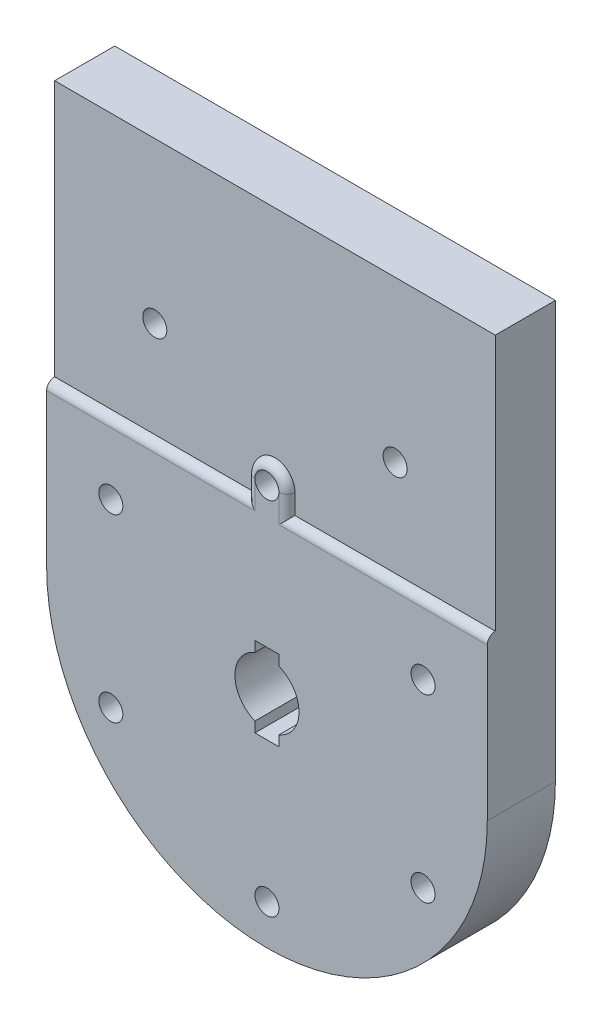
ISO-10303-21;
HEADER;
FILE_DESCRIPTION(('STEP AP214'),'2;1');
FILE_NAME('part.step','',(''),(''),'','','');
FILE_SCHEMA(('AUTOMOTIVE_DESIGN { 1 0 10303 214 1 1 1 1 }'));
ENDSEC;
DATA;
#1=APPLICATION_CONTEXT('core data for automotive mechanical design processes');
#2=APPLICATION_PROTOCOL_DEFINITION('international standard','automotive_design',2000,#1);
#3=PRODUCT_CONTEXT('',#1,'mechanical');
#4=PRODUCT('Part','Part','',(#3));
#5=PRODUCT_RELATED_PRODUCT_CATEGORY('part','',(#4));
#6=PRODUCT_DEFINITION_FORMATION('','',#4);
#7=PRODUCT_DEFINITION_CONTEXT('part definition',#1,'design');
#8=PRODUCT_DEFINITION('design','',#6,#7);
#9=PRODUCT_DEFINITION_SHAPE('','',#8);
#10=(LENGTH_UNIT() NAMED_UNIT(*) SI_UNIT(.MILLI.,.METRE.));
#11=(NAMED_UNIT(*) PLANE_ANGLE_UNIT() SI_UNIT($,.RADIAN.));
#12=(NAMED_UNIT(*) SI_UNIT($,.STERADIAN.) SOLID_ANGLE_UNIT());
#13=UNCERTAINTY_MEASURE_WITH_UNIT(LENGTH_MEASURE(1.E-05),#10,'distance_accuracy_value','');
#14=(GEOMETRIC_REPRESENTATION_CONTEXT(3) GLOBAL_UNCERTAINTY_ASSIGNED_CONTEXT((#13)) GLOBAL_UNIT_ASSIGNED_CONTEXT((#10,
#11,#12)) REPRESENTATION_CONTEXT('',''));
#15=CARTESIAN_POINT('',(0.,0.,0.));
#16=DIRECTION('',(0.,0.,1.));
#17=DIRECTION('',(1.,0.,0.));
#18=AXIS2_PLACEMENT_3D('',#15,#16,#17);
#19=CARTESIAN_POINT('',(19.4855715851503,11.2500000000007,0.));
#20=DIRECTION('',(0.,0.,1.));
#21=DIRECTION('',(1.,0.,0.));
#22=AXIS2_PLACEMENT_3D('',#19,#20,#21);
#23=CYLINDRICAL_SURFACE('',#22,1.50000000000181);
#24=CARTESIAN_POINT('',(19.4855715851503,11.2500000000007,8.5));
#25=DIRECTION('',(0.,0.,1.));
#26=DIRECTION('',(1.,0.,0.));
#27=AXIS2_PLACEMENT_3D('',#24,#25,#26);
#28=CIRCLE('',#27,1.50000000000181);
#29=CARTESIAN_POINT('',(20.9855715851521,11.2500000000007,8.5));
#30=VERTEX_POINT('',#29);
#31=EDGE_CURVE('E586',#30,#30,#28,.T.);
#32=ORIENTED_EDGE('',*,*,#31,.T.);
#33=EDGE_LOOP('',(#32));
#34=FACE_BOUND('',#33,.T.);
#35=CARTESIAN_POINT('',(19.4855715851503,11.2500000000007,4.));
#36=DIRECTION('',(0.,0.,-1.));
#37=DIRECTION('',(-1.,0.,0.));
#38=AXIS2_PLACEMENT_3D('',#35,#36,#37);
#39=CIRCLE('',#38,1.50000000000181);
#40=CARTESIAN_POINT('',(17.9855715851485,11.2500000000007,4.));
#41=VERTEX_POINT('',#40);
#42=EDGE_CURVE('E261',#41,#41,#39,.F.);
#43=ORIENTED_EDGE('',*,*,#42,.F.);
#44=EDGE_LOOP('',(#43));
#45=FACE_BOUND('',#44,.T.);
#46=ADVANCED_FACE('F257',(#34,#45),#23,.F.);
#47=CARTESIAN_POINT('',(0.,22.5,0.));
#48=DIRECTION('',(0.,0.,1.));
#49=DIRECTION('',(1.,0.,0.));
#50=AXIS2_PLACEMENT_3D('',#47,#48,#49);
#51=CYLINDRICAL_SURFACE('',#50,1.50000000000181);
#52=CARTESIAN_POINT('',(0.,22.5,8.5));
#53=DIRECTION('',(0.,0.,1.));
#54=DIRECTION('',(1.,0.,0.));
#55=AXIS2_PLACEMENT_3D('',#52,#53,#54);
#56=CIRCLE('',#55,1.50000000000181);
#57=CARTESIAN_POINT('',(1.50000000000001,22.5,8.5));
#58=VERTEX_POINT('',#57);
#59=CARTESIAN_POINT('',(-1.49999999999999,22.5,8.5));
#60=VERTEX_POINT('',#59);
#61=EDGE_CURVE('E410',#58,#60,#56,.T.);
#62=ORIENTED_EDGE('',*,*,#61,.T.);
#63=EDGE_CURVE('E585',#60,#58,#56,.T.);
#64=ORIENTED_EDGE('',*,*,#63,.T.);
#65=EDGE_LOOP('',(#62,#64));
#66=FACE_BOUND('',#65,.T.);
#67=CARTESIAN_POINT('',(0.,22.5,4.));
#68=DIRECTION('',(0.,0.,-1.));
#69=DIRECTION('',(-1.,0.,0.));
#70=AXIS2_PLACEMENT_3D('',#67,#68,#69);
#71=CIRCLE('',#70,1.50000000000181);
#72=CARTESIAN_POINT('',(-1.50000000000181,22.5,4.));
#73=VERTEX_POINT('',#72);
#74=EDGE_CURVE('E439',#73,#73,#71,.F.);
#75=ORIENTED_EDGE('',*,*,#74,.F.);
#76=EDGE_LOOP('',(#75));
#77=FACE_BOUND('',#76,.T.);
#78=ADVANCED_FACE('F451',(#66,#77),#51,.F.);
#79=CARTESIAN_POINT('',(1.70071014032744E-12,-22.5,0.));
#80=DIRECTION('',(0.,0.,1.));
#81=DIRECTION('',(1.,0.,0.));
#82=AXIS2_PLACEMENT_3D('',#79,#80,#81);
#83=CYLINDRICAL_SURFACE('',#82,1.50000000000181);
#84=CARTESIAN_POINT('',(1.70071014032744E-12,-22.5,8.5));
#85=DIRECTION('',(0.,0.,1.));
#86=DIRECTION('',(1.,0.,0.));
#87=AXIS2_PLACEMENT_3D('',#84,#85,#86);
#88=CIRCLE('',#87,1.50000000000181);
#89=CARTESIAN_POINT('',(1.50000000000351,-22.5,8.5));
#90=VERTEX_POINT('',#89);
#91=EDGE_CURVE('E604',#90,#90,#88,.T.);
#92=ORIENTED_EDGE('',*,*,#91,.T.);
#93=EDGE_LOOP('',(#92));
#94=FACE_BOUND('',#93,.T.);
#95=CARTESIAN_POINT('',(1.70071014032744E-12,-22.5,4.));
#96=DIRECTION('',(0.,0.,-1.));
#97=DIRECTION('',(-1.,0.,0.));
#98=AXIS2_PLACEMENT_3D('',#95,#96,#97);
#99=CIRCLE('',#98,1.50000000000181);
#100=CARTESIAN_POINT('',(-1.50000000000011,-22.5,4.));
#101=VERTEX_POINT('',#100);
#102=EDGE_CURVE('E436',#101,#101,#99,.F.);
#103=ORIENTED_EDGE('',*,*,#102,.F.);
#104=EDGE_LOOP('',(#103));
#105=FACE_BOUND('',#104,.T.);
#106=ADVANCED_FACE('F457',(#94,#105),#83,.F.);
#107=CARTESIAN_POINT('',(-19.4855715851486,-11.2500000000007,0.));
#108=DIRECTION('',(0.,0.,1.));
#109=DIRECTION('',(1.,0.,0.));
#110=AXIS2_PLACEMENT_3D('',#107,#108,#109);
#111=CYLINDRICAL_SURFACE('',#110,1.50000000000181);
#112=CARTESIAN_POINT('',(-19.4855715851486,-11.2500000000007,8.5));
#113=DIRECTION('',(0.,0.,1.));
#114=DIRECTION('',(1.,0.,0.));
#115=AXIS2_PLACEMENT_3D('',#112,#113,#114);
#116=CIRCLE('',#115,1.50000000000181);
#117=CARTESIAN_POINT('',(-17.9855715851468,-11.2500000000007,8.5));
#118=VERTEX_POINT('',#117);
#119=EDGE_CURVE('E600',#118,#118,#116,.T.);
#120=ORIENTED_EDGE('',*,*,#119,.T.);
#121=EDGE_LOOP('',(#120));
#122=FACE_BOUND('',#121,.T.);
#123=CARTESIAN_POINT('',(-19.4855715851486,-11.2500000000007,4.));
#124=DIRECTION('',(0.,0.,-1.));
#125=DIRECTION('',(-1.,0.,0.));
#126=AXIS2_PLACEMENT_3D('',#123,#124,#125);
#127=CIRCLE('',#126,1.50000000000181);
#128=CARTESIAN_POINT('',(-20.9855715851504,-11.2500000000007,4.));
#129=VERTEX_POINT('',#128);
#130=EDGE_CURVE('E432',#129,#129,#127,.F.);
#131=ORIENTED_EDGE('',*,*,#130,.F.);
#132=EDGE_LOOP('',(#131));
#133=FACE_BOUND('',#132,.T.);
#134=ADVANCED_FACE('F477',(#122,#133),#111,.F.);
#135=CARTESIAN_POINT('',(-19.4855715851495,11.2499999999992,0.));
#136=DIRECTION('',(0.,0.,1.));
#137=DIRECTION('',(1.,0.,0.));
#138=AXIS2_PLACEMENT_3D('',#135,#136,#137);
#139=CYLINDRICAL_SURFACE('',#138,1.50000000000181);
#140=CARTESIAN_POINT('',(-19.4855715851495,11.2499999999992,8.5));
#141=DIRECTION('',(0.,0.,1.));
#142=DIRECTION('',(1.,0.,0.));
#143=AXIS2_PLACEMENT_3D('',#140,#141,#142);
#144=CIRCLE('',#143,1.50000000000181);
#145=CARTESIAN_POINT('',(-17.9855715851476,11.2499999999992,8.5));
#146=VERTEX_POINT('',#145);
#147=EDGE_CURVE('E596',#146,#146,#144,.T.);
#148=ORIENTED_EDGE('',*,*,#147,.T.);
#149=EDGE_LOOP('',(#148));
#150=FACE_BOUND('',#149,.T.);
#151=CARTESIAN_POINT('',(-19.4855715851495,11.2499999999992,4.));
#152=DIRECTION('',(0.,0.,-1.));
#153=DIRECTION('',(-1.,0.,0.));
#154=AXIS2_PLACEMENT_3D('',#151,#152,#153);
#155=CIRCLE('',#154,1.50000000000181);
#156=CARTESIAN_POINT('',(-20.9855715851513,11.2499999999992,4.));
#157=VERTEX_POINT('',#156);
#158=EDGE_CURVE('E427',#157,#157,#155,.F.);
#159=ORIENTED_EDGE('',*,*,#158,.F.);
#160=EDGE_LOOP('',(#159));
#161=FACE_BOUND('',#160,.T.);
#162=ADVANCED_FACE('F473',(#150,#161),#139,.F.);
#163=CARTESIAN_POINT('',(19.4855715851511,-11.2499999999993,0.));
#164=DIRECTION('',(0.,0.,1.));
#165=DIRECTION('',(1.,0.,0.));
#166=AXIS2_PLACEMENT_3D('',#163,#164,#165);
#167=CYLINDRICAL_SURFACE('',#166,1.50000000000181);
#168=CARTESIAN_POINT('',(19.4855715851511,-11.2499999999993,8.5));
#169=DIRECTION('',(0.,0.,1.));
#170=DIRECTION('',(1.,0.,0.));
#171=AXIS2_PLACEMENT_3D('',#168,#169,#170);
#172=CIRCLE('',#171,1.50000000000181);
#173=CARTESIAN_POINT('',(20.985571585153,-11.2499999999993,8.5));
#174=VERTEX_POINT('',#173);
#175=EDGE_CURVE('E584',#174,#174,#172,.T.);
#176=ORIENTED_EDGE('',*,*,#175,.T.);
#177=EDGE_LOOP('',(#176));
#178=FACE_BOUND('',#177,.T.);
#179=CARTESIAN_POINT('',(19.4855715851511,-11.2499999999993,4.));
#180=DIRECTION('',(0.,0.,-1.));
#181=DIRECTION('',(-1.,0.,0.));
#182=AXIS2_PLACEMENT_3D('',#179,#180,#181);
#183=CIRCLE('',#182,1.50000000000181);
#184=CARTESIAN_POINT('',(17.9855715851493,-11.2499999999993,4.));
#185=VERTEX_POINT('',#184);
#186=EDGE_CURVE('E423',#185,#185,#183,.F.);
#187=ORIENTED_EDGE('',*,*,#186,.F.);
#188=EDGE_LOOP('',(#187));
#189=FACE_BOUND('',#188,.T.);
#190=ADVANCED_FACE('F476',(#178,#189),#167,.F.);
#191=CARTESIAN_POINT('',(0.,52.,8.5));
#192=DIRECTION('',(0.,1.,0.));
#193=DIRECTION('',(0.,0.,1.));
#194=AXIS2_PLACEMENT_3D('',#191,#192,#193);
#195=PLANE('',#194);
#196=DIRECTION('',(0.,0.,1.));
#197=VECTOR('',#196,1.);
#198=CARTESIAN_POINT('',(-27.5,52.,0.));
#199=LINE('',#198,#197);
#200=CARTESIAN_POINT('',(-27.5,52.,0.));
#201=VERTEX_POINT('',#200);
#202=CARTESIAN_POINT('',(-27.5,52.,7.5));
#203=VERTEX_POINT('',#202);
#204=EDGE_CURVE('E640',#201,#203,#199,.T.);
#205=ORIENTED_EDGE('',*,*,#204,.T.);
#206=DIRECTION('',(-1.,0.,0.));
#207=VECTOR('',#206,1.);
#208=CARTESIAN_POINT('',(0.,52.,7.5));
#209=LINE('',#208,#207);
#210=CARTESIAN_POINT('',(27.5,52.,7.5));
#211=VERTEX_POINT('',#210);
#212=EDGE_CURVE('E561',#211,#203,#209,.T.);
#213=ORIENTED_EDGE('',*,*,#212,.F.);
#214=DIRECTION('',(0.,0.,1.));
#215=VECTOR('',#214,1.);
#216=CARTESIAN_POINT('',(27.5,52.,0.));
#217=LINE('',#216,#215);
#218=CARTESIAN_POINT('',(27.5,52.,0.));
#219=VERTEX_POINT('',#218);
#220=EDGE_CURVE('E636',#219,#211,#217,.T.);
#221=ORIENTED_EDGE('',*,*,#220,.F.);
#222=DIRECTION('',(1.,0.,0.));
#223=VECTOR('',#222,1.);
#224=CARTESIAN_POINT('',(0.,52.,0.));
#225=LINE('',#224,#223);
#226=EDGE_CURVE('E650',#201,#219,#225,.T.);
#227=ORIENTED_EDGE('',*,*,#226,.F.);
#228=EDGE_LOOP('',(#205,#213,#221,#227));
#229=FACE_BOUND('',#228,.T.);
#230=ADVANCED_FACE('F471',(#229),#195,.T.);
#231=CARTESIAN_POINT('',(15.,32.,0.));
#232=DIRECTION('',(0.,0.,1.));
#233=DIRECTION('',(1.,0.,0.));
#234=AXIS2_PLACEMENT_3D('',#231,#232,#233);
#235=CYLINDRICAL_SURFACE('',#234,1.5);
#236=CARTESIAN_POINT('',(15.,32.,0.));
#237=DIRECTION('',(0.,0.,1.));
#238=DIRECTION('',(1.,0.,0.));
#239=AXIS2_PLACEMENT_3D('',#236,#237,#238);
#240=CIRCLE('',#239,1.5);
#241=CARTESIAN_POINT('',(16.5,32.,0.));
#242=VERTEX_POINT('',#241);
#243=EDGE_CURVE('E581',#242,#242,#240,.T.);
#244=ORIENTED_EDGE('',*,*,#243,.F.);
#245=EDGE_LOOP('',(#244));
#246=FACE_BOUND('',#245,.T.);
#247=CARTESIAN_POINT('',(15.,32.,7.5));
#248=DIRECTION('',(0.,0.,1.));
#249=DIRECTION('',(1.,0.,0.));
#250=AXIS2_PLACEMENT_3D('',#247,#248,#249);
#251=CIRCLE('',#250,1.5);
#252=CARTESIAN_POINT('',(16.5,32.,7.5));
#253=VERTEX_POINT('',#252);
#254=EDGE_CURVE('E577',#253,#253,#251,.F.);
#255=ORIENTED_EDGE('',*,*,#254,.F.);
#256=EDGE_LOOP('',(#255));
#257=FACE_BOUND('',#256,.T.);
#258=ADVANCED_FACE('F467',(#246,#257),#235,.F.);
#259=CARTESIAN_POINT('',(-15.,32.,0.));
#260=DIRECTION('',(0.,0.,1.));
#261=DIRECTION('',(1.,0.,0.));
#262=AXIS2_PLACEMENT_3D('',#259,#260,#261);
#263=CYLINDRICAL_SURFACE('',#262,1.5);
#264=CARTESIAN_POINT('',(-15.,32.,0.));
#265=DIRECTION('',(0.,0.,1.));
#266=DIRECTION('',(1.,0.,0.));
#267=AXIS2_PLACEMENT_3D('',#264,#265,#266);
#268=CIRCLE('',#267,1.5);
#269=CARTESIAN_POINT('',(-13.5,32.,0.));
#270=VERTEX_POINT('',#269);
#271=EDGE_CURVE('E589',#270,#270,#268,.T.);
#272=ORIENTED_EDGE('',*,*,#271,.F.);
#273=EDGE_LOOP('',(#272));
#274=FACE_BOUND('',#273,.T.);
#275=CARTESIAN_POINT('',(-15.,32.,7.5));
#276=DIRECTION('',(0.,0.,1.));
#277=DIRECTION('',(1.,0.,0.));
#278=AXIS2_PLACEMENT_3D('',#275,#276,#277);
#279=CIRCLE('',#278,1.5);
#280=CARTESIAN_POINT('',(-13.5,32.,7.5));
#281=VERTEX_POINT('',#280);
#282=EDGE_CURVE('E573',#281,#281,#279,.F.);
#283=ORIENTED_EDGE('',*,*,#282,.F.);
#284=EDGE_LOOP('',(#283));
#285=FACE_BOUND('',#284,.T.);
#286=ADVANCED_FACE('F463',(#274,#285),#263,.F.);
#287=CARTESIAN_POINT('',(0.,0.,8.5));
#288=DIRECTION('',(0.,0.,1.));
#289=DIRECTION('',(1.,0.,0.));
#290=AXIS2_PLACEMENT_3D('',#287,#288,#289);
#291=PLANE('',#290);
#292=ORIENTED_EDGE('',*,*,#175,.F.);
#293=EDGE_LOOP('',(#292));
#294=FACE_BOUND('',#293,.T.);
#295=ORIENTED_EDGE('',*,*,#147,.F.);
#296=EDGE_LOOP('',(#295));
#297=FACE_BOUND('',#296,.T.);
#298=ORIENTED_EDGE('',*,*,#119,.F.);
#299=EDGE_LOOP('',(#298));
#300=FACE_BOUND('',#299,.T.);
#301=ORIENTED_EDGE('',*,*,#91,.F.);
#302=EDGE_LOOP('',(#301));
#303=FACE_BOUND('',#302,.T.);
#304=DIRECTION('',(1.,0.,0.));
#305=VECTOR('',#304,1.);
#306=CARTESIAN_POINT('',(2.50000000000001,19.,8.5));
#307=LINE('',#306,#305);
#308=CARTESIAN_POINT('',(27.5,19.,8.5));
#309=VERTEX_POINT('',#308);
#310=CARTESIAN_POINT('',(1.50000000000001,19.,8.5));
#311=VERTEX_POINT('',#310);
#312=EDGE_CURVE('E275',#309,#311,#307,.F.);
#313=ORIENTED_EDGE('',*,*,#312,.T.);
#314=DIRECTION('',(0.,1.,0.));
#315=VECTOR('',#314,1.);
#316=CARTESIAN_POINT('',(1.50000000000002,0.,8.5));
#317=LINE('',#316,#315);
#318=EDGE_CURVE('E722',#311,#58,#317,.T.);
#319=ORIENTED_EDGE('',*,*,#318,.T.);
#320=ORIENTED_EDGE('',*,*,#63,.F.);
#321=DIRECTION('',(0.,1.,0.));
#322=VECTOR('',#321,1.);
#323=CARTESIAN_POINT('',(-1.49999999999999,20.,8.5));
#324=LINE('',#323,#322);
#325=CARTESIAN_POINT('',(-1.49999999999999,19.,8.5));
#326=VERTEX_POINT('',#325);
#327=EDGE_CURVE('E282',#60,#326,#324,.F.);
#328=ORIENTED_EDGE('',*,*,#327,.T.);
#329=DIRECTION('',(1.,0.,0.));
#330=VECTOR('',#329,1.);
#331=CARTESIAN_POINT('',(-27.5,19.,8.5));
#332=LINE('',#331,#330);
#333=CARTESIAN_POINT('',(-27.5,19.,8.5));
#334=VERTEX_POINT('',#333);
#335=EDGE_CURVE('E551',#326,#334,#332,.F.);
#336=ORIENTED_EDGE('',*,*,#335,.T.);
#337=DIRECTION('',(0.,1.,0.));
#338=VECTOR('',#337,1.);
#339=CARTESIAN_POINT('',(-27.5,0.,8.5));
#340=LINE('',#339,#338);
#341=CARTESIAN_POINT('',(-27.5,0.,8.5));
#342=VERTEX_POINT('',#341);
#343=EDGE_CURVE('E559',#342,#334,#340,.T.);
#344=ORIENTED_EDGE('',*,*,#343,.F.);
#345=CARTESIAN_POINT('',(0.,0.,8.5));
#346=DIRECTION('',(0.,0.,1.));
#347=DIRECTION('',(1.,0.,0.));
#348=AXIS2_PLACEMENT_3D('',#345,#346,#347);
#349=CIRCLE('',#348,27.5);
#350=CARTESIAN_POINT('',(27.5,0.,8.5));
#351=VERTEX_POINT('',#350);
#352=EDGE_CURVE('E608',#342,#351,#349,.T.);
#353=ORIENTED_EDGE('',*,*,#352,.T.);
#354=DIRECTION('',(0.,1.,0.));
#355=VECTOR('',#354,1.);
#356=CARTESIAN_POINT('',(27.5,0.,8.5));
#357=LINE('',#356,#355);
#358=EDGE_CURVE('E616',#351,#309,#357,.T.);
#359=ORIENTED_EDGE('',*,*,#358,.T.);
#360=EDGE_LOOP('',(#313,#319,#320,#328,#336,#344,#353,#359));
#361=FACE_BOUND('',#360,.T.);
#362=ORIENTED_EDGE('',*,*,#31,.F.);
#363=EDGE_LOOP('',(#362));
#364=FACE_BOUND('',#363,.T.);
#365=CARTESIAN_POINT('',(0.,0.,8.5));
#366=DIRECTION('',(0.,0.,1.));
#367=DIRECTION('',(1.,0.,0.));
#368=AXIS2_PLACEMENT_3D('',#365,#366,#367);
#369=CIRCLE('',#368,4.);
#370=CARTESIAN_POINT('',(-1.5,3.70809924354783,8.5));
#371=VERTEX_POINT('',#370);
#372=CARTESIAN_POINT('',(-1.5,-3.70809924354783,8.5));
#373=VERTEX_POINT('',#372);
#374=EDGE_CURVE('E645',#371,#373,#369,.T.);
#375=ORIENTED_EDGE('',*,*,#374,.F.);
#376=DIRECTION('',(0.,-1.,0.));
#377=VECTOR('',#376,1.);
#378=CARTESIAN_POINT('',(-1.5,0.,8.5));
#379=LINE('',#378,#377);
#380=CARTESIAN_POINT('',(-1.5,5.,8.5));
#381=VERTEX_POINT('',#380);
#382=EDGE_CURVE('E649',#381,#371,#379,.T.);
#383=ORIENTED_EDGE('',*,*,#382,.F.);
#384=DIRECTION('',(1.,0.,0.));
#385=VECTOR('',#384,1.);
#386=CARTESIAN_POINT('',(0.,5.,8.5));
#387=LINE('',#386,#385);
#388=CARTESIAN_POINT('',(1.5,5.,8.5));
#389=VERTEX_POINT('',#388);
#390=EDGE_CURVE('E655',#381,#389,#387,.T.);
#391=ORIENTED_EDGE('',*,*,#390,.T.);
#392=DIRECTION('',(0.,-1.,0.));
#393=VECTOR('',#392,1.);
#394=CARTESIAN_POINT('',(1.5,0.,8.5));
#395=LINE('',#394,#393);
#396=CARTESIAN_POINT('',(1.5,3.70809924354783,8.5));
#397=VERTEX_POINT('',#396);
#398=EDGE_CURVE('E659',#389,#397,#395,.T.);
#399=ORIENTED_EDGE('',*,*,#398,.T.);
#400=CARTESIAN_POINT('',(1.5,-3.70809924354783,8.5));
#401=VERTEX_POINT('',#400);
#402=EDGE_CURVE('E651',#401,#397,#369,.T.);
#403=ORIENTED_EDGE('',*,*,#402,.F.);
#404=CARTESIAN_POINT('',(1.5,-5.,8.5));
#405=VERTEX_POINT('',#404);
#406=EDGE_CURVE('E662',#401,#405,#395,.T.);
#407=ORIENTED_EDGE('',*,*,#406,.T.);
#408=DIRECTION('',(1.,0.,0.));
#409=VECTOR('',#408,1.);
#410=CARTESIAN_POINT('',(0.,-5.,8.5));
#411=LINE('',#410,#409);
#412=CARTESIAN_POINT('',(-1.5,-5.,8.5));
#413=VERTEX_POINT('',#412);
#414=EDGE_CURVE('E663',#413,#405,#411,.T.);
#415=ORIENTED_EDGE('',*,*,#414,.F.);
#416=EDGE_CURVE('E656',#373,#413,#379,.T.);
#417=ORIENTED_EDGE('',*,*,#416,.F.);
#418=EDGE_LOOP('',(#375,#383,#391,#399,#403,#407,#415,#417));
#419=FACE_BOUND('',#418,.T.);
#420=ADVANCED_FACE('F466',(#294,#297,#300,#303,#361,#364,#419),#291,.T.);
#421=CARTESIAN_POINT('',(0.,0.,0.));
#422=DIRECTION('',(0.,0.,1.));
#423=DIRECTION('',(1.,0.,0.));
#424=AXIS2_PLACEMENT_3D('',#421,#422,#423);
#425=PLANE('',#424);
#426=CARTESIAN_POINT('',(0.,22.5,0.));
#427=DIRECTION('',(0.,0.,-1.));
#428=DIRECTION('',(-1.,0.,0.));
#429=AXIS2_PLACEMENT_3D('',#426,#427,#428);
#430=CIRCLE('',#429,3.);
#431=CARTESIAN_POINT('',(-3.,22.5,0.));
#432=VERTEX_POINT('',#431);
#433=EDGE_CURVE('E1020',#432,#432,#430,.T.);
#434=ORIENTED_EDGE('',*,*,#433,.F.);
#435=EDGE_LOOP('',(#434));
#436=FACE_BOUND('',#435,.T.);
#437=CARTESIAN_POINT('',(19.4855715851492,11.2499999999989,0.));
#438=DIRECTION('',(0.,0.,-1.));
#439=DIRECTION('',(-1.,0.,0.));
#440=AXIS2_PLACEMENT_3D('',#437,#438,#439);
#441=CIRCLE('',#440,3.0000000000012);
#442=CARTESIAN_POINT('',(16.485571585148,11.2499999999989,0.));
#443=VERTEX_POINT('',#442);
#444=EDGE_CURVE('E1007',#443,#443,#441,.T.);
#445=ORIENTED_EDGE('',*,*,#444,.F.);
#446=EDGE_LOOP('',(#445));
#447=FACE_BOUND('',#446,.T.);
#448=CARTESIAN_POINT('',(19.485571585148,-11.2500000000011,0.));
#449=DIRECTION('',(0.,0.,-1.));
#450=DIRECTION('',(-1.,0.,0.));
#451=AXIS2_PLACEMENT_3D('',#448,#449,#450);
#452=CIRCLE('',#451,3.00000000000236);
#453=CARTESIAN_POINT('',(16.4855715851456,-11.2500000000011,0.));
#454=VERTEX_POINT('',#453);
#455=EDGE_CURVE('E1012',#454,#454,#452,.T.);
#456=ORIENTED_EDGE('',*,*,#455,.F.);
#457=EDGE_LOOP('',(#456));
#458=FACE_BOUND('',#457,.T.);
#459=CARTESIAN_POINT('',(-2.54968748284212E-12,-22.5,0.));
#460=DIRECTION('',(0.,0.,-1.));
#461=DIRECTION('',(-1.,0.,0.));
#462=AXIS2_PLACEMENT_3D('',#459,#460,#461);
#463=CIRCLE('',#462,3.00000000000259);
#464=CARTESIAN_POINT('',(-3.00000000000514,-22.5,0.));
#465=VERTEX_POINT('',#464);
#466=EDGE_CURVE('E1037',#465,#465,#463,.T.);
#467=ORIENTED_EDGE('',*,*,#466,.F.);
#468=EDGE_LOOP('',(#467));
#469=FACE_BOUND('',#468,.T.);
#470=CARTESIAN_POINT('',(-19.4855715851518,-11.2499999999989,0.));
#471=DIRECTION('',(0.,0.,-1.));
#472=DIRECTION('',(-1.,0.,0.));
#473=AXIS2_PLACEMENT_3D('',#470,#471,#472);
#474=CIRCLE('',#473,3.00000000000161);
#475=CARTESIAN_POINT('',(-22.4855715851534,-11.2499999999989,0.));
#476=VERTEX_POINT('',#475);
#477=EDGE_CURVE('E1029',#476,#476,#474,.T.);
#478=ORIENTED_EDGE('',*,*,#477,.F.);
#479=EDGE_LOOP('',(#478));
#480=FACE_BOUND('',#479,.T.);
#481=CARTESIAN_POINT('',(-19.4855715851505,11.2500000000011,0.));
#482=DIRECTION('',(0.,0.,-1.));
#483=DIRECTION('',(-1.,0.,0.));
#484=AXIS2_PLACEMENT_3D('',#481,#482,#483);
#485=CIRCLE('',#484,3.00000000000034);
#486=CARTESIAN_POINT('',(-22.4855715851508,11.2500000000011,0.));
#487=VERTEX_POINT('',#486);
#488=EDGE_CURVE('E1021',#487,#487,#485,.T.);
#489=ORIENTED_EDGE('',*,*,#488,.F.);
#490=EDGE_LOOP('',(#489));
#491=FACE_BOUND('',#490,.T.);
#492=ORIENTED_EDGE('',*,*,#271,.T.);
#493=EDGE_LOOP('',(#492));
#494=FACE_BOUND('',#493,.T.);
#495=ORIENTED_EDGE('',*,*,#243,.T.);
#496=EDGE_LOOP('',(#495));
#497=FACE_BOUND('',#496,.T.);
#498=CARTESIAN_POINT('',(0.,0.,0.));
#499=DIRECTION('',(0.,0.,1.));
#500=DIRECTION('',(1.,0.,0.));
#501=AXIS2_PLACEMENT_3D('',#498,#499,#500);
#502=CIRCLE('',#501,4.);
#503=CARTESIAN_POINT('',(-1.5,3.70809924354783,0.));
#504=VERTEX_POINT('',#503);
#505=CARTESIAN_POINT('',(-1.5,-3.70809924354783,0.));
#506=VERTEX_POINT('',#505);
#507=EDGE_CURVE('E635',#504,#506,#502,.T.);
#508=ORIENTED_EDGE('',*,*,#507,.T.);
#509=DIRECTION('',(0.,-1.,0.));
#510=VECTOR('',#509,1.);
#511=CARTESIAN_POINT('',(-1.5,0.,0.));
#512=LINE('',#511,#510);
#513=CARTESIAN_POINT('',(-1.5,-5.,0.));
#514=VERTEX_POINT('',#513);
#515=EDGE_CURVE('E676',#506,#514,#512,.T.);
#516=ORIENTED_EDGE('',*,*,#515,.T.);
#517=DIRECTION('',(1.,0.,0.));
#518=VECTOR('',#517,1.);
#519=CARTESIAN_POINT('',(0.,-5.,0.));
#520=LINE('',#519,#518);
#521=CARTESIAN_POINT('',(1.5,-5.,0.));
#522=VERTEX_POINT('',#521);
#523=EDGE_CURVE('E684',#514,#522,#520,.T.);
#524=ORIENTED_EDGE('',*,*,#523,.T.);
#525=DIRECTION('',(0.,-1.,0.));
#526=VECTOR('',#525,1.);
#527=CARTESIAN_POINT('',(1.5,0.,0.));
#528=LINE('',#527,#526);
#529=CARTESIAN_POINT('',(1.5,-3.70809924354783,0.));
#530=VERTEX_POINT('',#529);
#531=EDGE_CURVE('E683',#530,#522,#528,.T.);
#532=ORIENTED_EDGE('',*,*,#531,.F.);
#533=CARTESIAN_POINT('',(1.5,3.70809924354783,0.));
#534=VERTEX_POINT('',#533);
#535=EDGE_CURVE('E671',#530,#534,#502,.T.);
#536=ORIENTED_EDGE('',*,*,#535,.T.);
#537=CARTESIAN_POINT('',(1.5,5.,0.));
#538=VERTEX_POINT('',#537);
#539=EDGE_CURVE('E679',#538,#534,#528,.T.);
#540=ORIENTED_EDGE('',*,*,#539,.F.);
#541=DIRECTION('',(1.,0.,0.));
#542=VECTOR('',#541,1.);
#543=CARTESIAN_POINT('',(0.,5.,0.));
#544=LINE('',#543,#542);
#545=CARTESIAN_POINT('',(-1.5,5.,0.));
#546=VERTEX_POINT('',#545);
#547=EDGE_CURVE('E675',#546,#538,#544,.T.);
#548=ORIENTED_EDGE('',*,*,#547,.F.);
#549=EDGE_CURVE('E670',#546,#504,#512,.T.);
#550=ORIENTED_EDGE('',*,*,#549,.T.);
#551=EDGE_LOOP('',(#508,#516,#524,#532,#536,#540,#548,#550));
#552=FACE_BOUND('',#551,.T.);
#553=DIRECTION('',(0.,1.,0.));
#554=VECTOR('',#553,1.);
#555=CARTESIAN_POINT('',(27.5,0.,0.));
#556=LINE('',#555,#554);
#557=CARTESIAN_POINT('',(27.5,0.,0.));
#558=VERTEX_POINT('',#557);
#559=EDGE_CURVE('E620',#558,#219,#556,.T.);
#560=ORIENTED_EDGE('',*,*,#559,.F.);
#561=CARTESIAN_POINT('',(0.,0.,0.));
#562=DIRECTION('',(0.,0.,1.));
#563=DIRECTION('',(1.,0.,0.));
#564=AXIS2_PLACEMENT_3D('',#561,#562,#563);
#565=CIRCLE('',#564,27.5);
#566=CARTESIAN_POINT('',(-27.5,0.,0.));
#567=VERTEX_POINT('',#566);
#568=EDGE_CURVE('E612',#567,#558,#565,.T.);
#569=ORIENTED_EDGE('',*,*,#568,.F.);
#570=DIRECTION('',(0.,1.,0.));
#571=VECTOR('',#570,1.);
#572=CARTESIAN_POINT('',(-27.5,0.,0.));
#573=LINE('',#572,#571);
#574=EDGE_CURVE('E615',#567,#201,#573,.T.);
#575=ORIENTED_EDGE('',*,*,#574,.T.);
#576=ORIENTED_EDGE('',*,*,#226,.T.);
#577=EDGE_LOOP('',(#560,#569,#575,#576));
#578=FACE_BOUND('',#577,.T.);
#579=ADVANCED_FACE('F503',(#436,#447,#458,#469,#480,#491,#494,#497,#552,#578),#425,.F.);
#580=CARTESIAN_POINT('',(0.,0.,8.5));
#581=DIRECTION('',(0.,0.,-1.));
#582=DIRECTION('',(-1.,0.,0.));
#583=AXIS2_PLACEMENT_3D('',#580,#581,#582);
#584=CYLINDRICAL_SURFACE('',#583,4.);
#585=ORIENTED_EDGE('',*,*,#507,.F.);
#586=DIRECTION('',(0.,0.,-1.));
#587=VECTOR('',#586,1.);
#588=CARTESIAN_POINT('',(-1.5,3.70809924354783,8.5));
#589=LINE('',#588,#587);
#590=EDGE_CURVE('E713',#371,#504,#589,.T.);
#591=ORIENTED_EDGE('',*,*,#590,.F.);
#592=ORIENTED_EDGE('',*,*,#374,.T.);
#593=DIRECTION('',(0.,0.,-1.));
#594=VECTOR('',#593,1.);
#595=CARTESIAN_POINT('',(-1.5,-3.70809924354783,8.5));
#596=LINE('',#595,#594);
#597=EDGE_CURVE('E691',#373,#506,#596,.T.);
#598=ORIENTED_EDGE('',*,*,#597,.T.);
#599=EDGE_LOOP('',(#585,#591,#592,#598));
#600=FACE_BOUND('',#599,.T.);
#601=ADVANCED_FACE('F507',(#600),#584,.F.);
#602=CARTESIAN_POINT('',(-1.5,0.,8.5));
#603=DIRECTION('',(1.,0.,0.));
#604=DIRECTION('',(0.,1.,0.));
#605=AXIS2_PLACEMENT_3D('',#602,#603,#604);
#606=PLANE('',#605);
#607=ORIENTED_EDGE('',*,*,#549,.F.);
#608=DIRECTION('',(0.,0.,-1.));
#609=VECTOR('',#608,1.);
#610=CARTESIAN_POINT('',(-1.5,5.,8.5));
#611=LINE('',#610,#609);
#612=EDGE_CURVE('E710',#381,#546,#611,.T.);
#613=ORIENTED_EDGE('',*,*,#612,.F.);
#614=ORIENTED_EDGE('',*,*,#382,.T.);
#615=ORIENTED_EDGE('',*,*,#590,.T.);
#616=EDGE_LOOP('',(#607,#613,#614,#615));
#617=FACE_BOUND('',#616,.T.);
#618=ADVANCED_FACE('F516',(#617),#606,.T.);
#619=CARTESIAN_POINT('',(0.,5.,8.5));
#620=DIRECTION('',(0.,1.,0.));
#621=DIRECTION('',(0.,0.,1.));
#622=AXIS2_PLACEMENT_3D('',#619,#620,#621);
#623=PLANE('',#622);
#624=ORIENTED_EDGE('',*,*,#547,.T.);
#625=DIRECTION('',(0.,0.,-1.));
#626=VECTOR('',#625,1.);
#627=CARTESIAN_POINT('',(1.5,5.,8.5));
#628=LINE('',#627,#626);
#629=EDGE_CURVE('E706',#389,#538,#628,.T.);
#630=ORIENTED_EDGE('',*,*,#629,.F.);
#631=ORIENTED_EDGE('',*,*,#390,.F.);
#632=ORIENTED_EDGE('',*,*,#612,.T.);
#633=EDGE_LOOP('',(#624,#630,#631,#632));
#634=FACE_BOUND('',#633,.T.);
#635=ADVANCED_FACE('F529',(#634),#623,.F.);
#636=CARTESIAN_POINT('',(1.5,0.,8.5));
#637=DIRECTION('',(1.,0.,0.));
#638=DIRECTION('',(0.,1.,0.));
#639=AXIS2_PLACEMENT_3D('',#636,#637,#638);
#640=PLANE('',#639);
#641=ORIENTED_EDGE('',*,*,#539,.T.);
#642=DIRECTION('',(0.,0.,-1.));
#643=VECTOR('',#642,1.);
#644=CARTESIAN_POINT('',(1.5,3.70809924354783,8.5));
#645=LINE('',#644,#643);
#646=EDGE_CURVE('E703',#397,#534,#645,.T.);
#647=ORIENTED_EDGE('',*,*,#646,.F.);
#648=ORIENTED_EDGE('',*,*,#398,.F.);
#649=ORIENTED_EDGE('',*,*,#629,.T.);
#650=EDGE_LOOP('',(#641,#647,#648,#649));
#651=FACE_BOUND('',#650,.T.);
#652=ADVANCED_FACE('F525',(#651),#640,.F.);
#653=ORIENTED_EDGE('',*,*,#535,.F.);
#654=DIRECTION('',(0.,0.,-1.));
#655=VECTOR('',#654,1.);
#656=CARTESIAN_POINT('',(1.5,-3.70809924354783,8.5));
#657=LINE('',#656,#655);
#658=EDGE_CURVE('E700',#401,#530,#657,.T.);
#659=ORIENTED_EDGE('',*,*,#658,.F.);
#660=ORIENTED_EDGE('',*,*,#402,.T.);
#661=ORIENTED_EDGE('',*,*,#646,.T.);
#662=EDGE_LOOP('',(#653,#659,#660,#661));
#663=FACE_BOUND('',#662,.T.);
#664=ADVANCED_FACE('F523',(#663),#584,.F.);
#665=ORIENTED_EDGE('',*,*,#531,.T.);
#666=DIRECTION('',(0.,0.,-1.));
#667=VECTOR('',#666,1.);
#668=CARTESIAN_POINT('',(1.5,-5.,8.5));
#669=LINE('',#668,#667);
#670=EDGE_CURVE('E697',#405,#522,#669,.T.);
#671=ORIENTED_EDGE('',*,*,#670,.F.);
#672=ORIENTED_EDGE('',*,*,#406,.F.);
#673=ORIENTED_EDGE('',*,*,#658,.T.);
#674=EDGE_LOOP('',(#665,#671,#672,#673));
#675=FACE_BOUND('',#674,.T.);
#676=ADVANCED_FACE('F519',(#675),#640,.F.);
#677=CARTESIAN_POINT('',(0.,-5.,8.5));
#678=DIRECTION('',(0.,1.,0.));
#679=DIRECTION('',(0.,0.,1.));
#680=AXIS2_PLACEMENT_3D('',#677,#678,#679);
#681=PLANE('',#680);
#682=ORIENTED_EDGE('',*,*,#523,.F.);
#683=DIRECTION('',(0.,0.,-1.));
#684=VECTOR('',#683,1.);
#685=CARTESIAN_POINT('',(-1.5,-5.,8.5));
#686=LINE('',#685,#684);
#687=EDGE_CURVE('E694',#413,#514,#686,.T.);
#688=ORIENTED_EDGE('',*,*,#687,.F.);
#689=ORIENTED_EDGE('',*,*,#414,.T.);
#690=ORIENTED_EDGE('',*,*,#670,.T.);
#691=EDGE_LOOP('',(#682,#688,#689,#690));
#692=FACE_BOUND('',#691,.T.);
#693=ADVANCED_FACE('F514',(#692),#681,.T.);
#694=ORIENTED_EDGE('',*,*,#515,.F.);
#695=ORIENTED_EDGE('',*,*,#597,.F.);
#696=ORIENTED_EDGE('',*,*,#416,.T.);
#697=ORIENTED_EDGE('',*,*,#687,.T.);
#698=EDGE_LOOP('',(#694,#695,#696,#697));
#699=FACE_BOUND('',#698,.T.);
#700=ADVANCED_FACE('F499',(#699),#606,.T.);
#701=CARTESIAN_POINT('',(0.,0.,0.));
#702=DIRECTION('',(0.,0.,1.));
#703=DIRECTION('',(1.,0.,0.));
#704=AXIS2_PLACEMENT_3D('',#701,#702,#703);
#705=CYLINDRICAL_SURFACE('',#704,27.5);
#706=ORIENTED_EDGE('',*,*,#352,.F.);
#707=DIRECTION('',(0.,0.,1.));
#708=VECTOR('',#707,1.);
#709=CARTESIAN_POINT('',(-27.5,0.,0.));
#710=LINE('',#709,#708);
#711=EDGE_CURVE('E623',#567,#342,#710,.T.);
#712=ORIENTED_EDGE('',*,*,#711,.F.);
#713=ORIENTED_EDGE('',*,*,#568,.T.);
#714=DIRECTION('',(0.,0.,1.));
#715=VECTOR('',#714,1.);
#716=CARTESIAN_POINT('',(27.5,0.,0.));
#717=LINE('',#716,#715);
#718=EDGE_CURVE('E631',#558,#351,#717,.T.);
#719=ORIENTED_EDGE('',*,*,#718,.T.);
#720=EDGE_LOOP('',(#706,#712,#713,#719));
#721=FACE_BOUND('',#720,.T.);
#722=ADVANCED_FACE('F492',(#721),#705,.T.);
#723=CARTESIAN_POINT('',(27.5,0.,0.));
#724=DIRECTION('',(1.,0.,0.));
#725=DIRECTION('',(0.,1.,0.));
#726=AXIS2_PLACEMENT_3D('',#723,#724,#725);
#727=PLANE('',#726);
#728=DIRECTION('',(0.,1.,0.));
#729=VECTOR('',#728,1.);
#730=CARTESIAN_POINT('',(27.5,0.,7.5));
#731=LINE('',#730,#729);
#732=CARTESIAN_POINT('',(27.5,20.,7.5));
#733=VERTEX_POINT('',#732);
#734=EDGE_CURVE('E567',#733,#211,#731,.T.);
#735=ORIENTED_EDGE('',*,*,#734,.F.);
#736=CARTESIAN_POINT('',(27.5,19.,7.5));
#737=DIRECTION('',(1.,0.,0.));
#738=DIRECTION('',(0.,1.,0.));
#739=AXIS2_PLACEMENT_3D('',#736,#737,#738);
#740=CIRCLE('',#739,1.);
#741=EDGE_CURVE('E267',#733,#309,#740,.T.);
#742=ORIENTED_EDGE('',*,*,#741,.T.);
#743=ORIENTED_EDGE('',*,*,#358,.F.);
#744=ORIENTED_EDGE('',*,*,#718,.F.);
#745=ORIENTED_EDGE('',*,*,#559,.T.);
#746=ORIENTED_EDGE('',*,*,#220,.T.);
#747=EDGE_LOOP('',(#735,#742,#743,#744,#745,#746));
#748=FACE_BOUND('',#747,.T.);
#749=ADVANCED_FACE('F488',(#748),#727,.T.);
#750=CARTESIAN_POINT('',(-27.5,0.,0.));
#751=DIRECTION('',(1.,0.,0.));
#752=DIRECTION('',(0.,1.,0.));
#753=AXIS2_PLACEMENT_3D('',#750,#751,#752);
#754=PLANE('',#753);
#755=ORIENTED_EDGE('',*,*,#343,.T.);
#756=CARTESIAN_POINT('',(-27.5,19.,7.5));
#757=DIRECTION('',(1.,0.,0.));
#758=DIRECTION('',(0.,1.,0.));
#759=AXIS2_PLACEMENT_3D('',#756,#757,#758);
#760=CIRCLE('',#759,1.);
#761=CARTESIAN_POINT('',(-27.5,20.,7.5));
#762=VERTEX_POINT('',#761);
#763=EDGE_CURVE('E12',#334,#762,#760,.F.);
#764=ORIENTED_EDGE('',*,*,#763,.T.);
#765=DIRECTION('',(0.,-1.,0.));
#766=VECTOR('',#765,1.);
#767=CARTESIAN_POINT('',(-27.5,0.,7.5));
#768=LINE('',#767,#766);
#769=EDGE_CURVE('E556',#203,#762,#768,.T.);
#770=ORIENTED_EDGE('',*,*,#769,.F.);
#771=ORIENTED_EDGE('',*,*,#204,.F.);
#772=ORIENTED_EDGE('',*,*,#574,.F.);
#773=ORIENTED_EDGE('',*,*,#711,.T.);
#774=EDGE_LOOP('',(#755,#764,#770,#771,#772,#773));
#775=FACE_BOUND('',#774,.T.);
#776=ADVANCED_FACE('F491',(#775),#754,.F.);
#777=CARTESIAN_POINT('',(0.,0.,7.5));
#778=DIRECTION('',(0.,0.,1.));
#779=DIRECTION('',(1.,0.,0.));
#780=AXIS2_PLACEMENT_3D('',#777,#778,#779);
#781=PLANE('',#780);
#782=CARTESIAN_POINT('',(0.,22.5,7.5));
#783=DIRECTION('',(0.,0.,1.));
#784=DIRECTION('',(1.,0.,0.));
#785=AXIS2_PLACEMENT_3D('',#782,#783,#784);
#786=CIRCLE('',#785,2.5);
#787=CARTESIAN_POINT('',(2.50000000000001,22.5,7.5));
#788=VERTEX_POINT('',#787);
#789=CARTESIAN_POINT('',(-2.49999999999999,22.5,7.5));
#790=VERTEX_POINT('',#789);
#791=EDGE_CURVE('E384',#788,#790,#786,.T.);
#792=ORIENTED_EDGE('',*,*,#791,.F.);
#793=DIRECTION('',(0.,1.,0.));
#794=VECTOR('',#793,1.);
#795=CARTESIAN_POINT('',(2.50000000000002,0.,7.5));
#796=LINE('',#795,#794);
#797=CARTESIAN_POINT('',(2.50000000000001,20.,7.5));
#798=VERTEX_POINT('',#797);
#799=EDGE_CURVE('E388',#798,#788,#796,.T.);
#800=ORIENTED_EDGE('',*,*,#799,.F.);
#801=DIRECTION('',(1.,0.,0.));
#802=VECTOR('',#801,1.);
#803=CARTESIAN_POINT('',(0.,20.,7.5));
#804=LINE('',#803,#802);
#805=EDGE_CURVE('E406',#798,#733,#804,.T.);
#806=ORIENTED_EDGE('',*,*,#805,.T.);
#807=ORIENTED_EDGE('',*,*,#734,.T.);
#808=ORIENTED_EDGE('',*,*,#212,.T.);
#809=ORIENTED_EDGE('',*,*,#769,.T.);
#810=CARTESIAN_POINT('',(-2.49999999999999,20.,7.5));
#811=VERTEX_POINT('',#810);
#812=EDGE_CURVE('E552',#762,#811,#804,.T.);
#813=ORIENTED_EDGE('',*,*,#812,.T.);
#814=DIRECTION('',(0.,1.,0.));
#815=VECTOR('',#814,1.);
#816=CARTESIAN_POINT('',(-2.49999999999998,0.,7.5));
#817=LINE('',#816,#815);
#818=EDGE_CURVE('E391',#811,#790,#817,.T.);
#819=ORIENTED_EDGE('',*,*,#818,.T.);
#820=EDGE_LOOP('',(#792,#800,#806,#807,#808,#809,#813,#819));
#821=FACE_BOUND('',#820,.T.);
#822=ORIENTED_EDGE('',*,*,#282,.T.);
#823=EDGE_LOOP('',(#822));
#824=FACE_BOUND('',#823,.T.);
#825=ORIENTED_EDGE('',*,*,#254,.T.);
#826=EDGE_LOOP('',(#825));
#827=FACE_BOUND('',#826,.T.);
#828=ADVANCED_FACE('F386',(#821,#824,#827),#781,.T.);
#829=CARTESIAN_POINT('',(0.,19.,7.5));
#830=DIRECTION('',(-1.,0.,0.));
#831=DIRECTION('',(0.,0.,1.));
#832=AXIS2_PLACEMENT_3D('',#829,#830,#831);
#833=CYLINDRICAL_SURFACE('',#832,1.);
#834=ORIENTED_EDGE('',*,*,#741,.F.);
#835=ORIENTED_EDGE('',*,*,#805,.F.);
#836=CARTESIAN_POINT('',(1.50000000000001,19.,7.5));
#837=DIRECTION('',(-0.707106781186548,0.707106781186547,0.));
#838=DIRECTION('',(0.707106781186547,0.707106781186548,0.));
#839=AXIS2_PLACEMENT_3D('',#836,#837,#838);
#840=ELLIPSE('',#839,1.41421356237309,1.);
#841=EDGE_CURVE('E396',#311,#798,#840,.T.);
#842=ORIENTED_EDGE('',*,*,#841,.F.);
#843=ORIENTED_EDGE('',*,*,#312,.F.);
#844=EDGE_LOOP('',(#834,#835,#842,#843));
#845=FACE_BOUND('',#844,.T.);
#846=ADVANCED_FACE('F259',(#845),#833,.T.);
#847=CARTESIAN_POINT('',(0.,19.,7.5));
#848=DIRECTION('',(-1.,0.,0.));
#849=DIRECTION('',(0.,0.,1.));
#850=AXIS2_PLACEMENT_3D('',#847,#848,#849);
#851=CYLINDRICAL_SURFACE('',#850,1.);
#852=ORIENTED_EDGE('',*,*,#763,.F.);
#853=ORIENTED_EDGE('',*,*,#335,.F.);
#854=CARTESIAN_POINT('',(-1.49999999999999,19.,7.5));
#855=DIRECTION('',(-0.707106781186547,-0.707106781186548,0.));
#856=DIRECTION('',(0.707106781186548,-0.707106781186547,0.));
#857=AXIS2_PLACEMENT_3D('',#854,#855,#856);
#858=ELLIPSE('',#857,1.4142135623731,1.);
#859=EDGE_CURVE('E412',#811,#326,#858,.F.);
#860=ORIENTED_EDGE('',*,*,#859,.F.);
#861=ORIENTED_EDGE('',*,*,#812,.F.);
#862=EDGE_LOOP('',(#852,#853,#860,#861));
#863=FACE_BOUND('',#862,.T.);
#864=ADVANCED_FACE('F541',(#863),#851,.T.);
#865=CARTESIAN_POINT('',(1.50000000000002,0.,7.5));
#866=DIRECTION('',(0.,1.,0.));
#867=DIRECTION('',(-1.,0.,0.));
#868=AXIS2_PLACEMENT_3D('',#865,#866,#867);
#869=CYLINDRICAL_SURFACE('',#868,1.);
#870=ORIENTED_EDGE('',*,*,#841,.T.);
#871=ORIENTED_EDGE('',*,*,#799,.T.);
#872=CARTESIAN_POINT('',(1.50000000000001,22.5,7.5));
#873=DIRECTION('',(0.,1.,0.));
#874=DIRECTION('',(0.,0.,1.));
#875=AXIS2_PLACEMENT_3D('',#872,#873,#874);
#876=CIRCLE('',#875,1.);
#877=EDGE_CURVE('E403',#58,#788,#876,.T.);
#878=ORIENTED_EDGE('',*,*,#877,.F.);
#879=ORIENTED_EDGE('',*,*,#318,.F.);
#880=EDGE_LOOP('',(#870,#871,#878,#879));
#881=FACE_BOUND('',#880,.T.);
#882=ADVANCED_FACE('F401',(#881),#869,.T.);
#883=CARTESIAN_POINT('',(-1.49999999999998,0.,7.5));
#884=DIRECTION('',(0.,-1.,0.));
#885=DIRECTION('',(1.,0.,0.));
#886=AXIS2_PLACEMENT_3D('',#883,#884,#885);
#887=CYLINDRICAL_SURFACE('',#886,1.);
#888=ORIENTED_EDGE('',*,*,#859,.T.);
#889=ORIENTED_EDGE('',*,*,#327,.F.);
#890=CARTESIAN_POINT('',(-1.49999999999999,22.5,7.5));
#891=DIRECTION('',(0.,1.,0.));
#892=DIRECTION('',(0.,0.,1.));
#893=AXIS2_PLACEMENT_3D('',#890,#891,#892);
#894=CIRCLE('',#893,1.);
#895=EDGE_CURVE('E413',#790,#60,#894,.T.);
#896=ORIENTED_EDGE('',*,*,#895,.F.);
#897=ORIENTED_EDGE('',*,*,#818,.F.);
#898=EDGE_LOOP('',(#888,#889,#896,#897));
#899=FACE_BOUND('',#898,.T.);
#900=ADVANCED_FACE('F536',(#899),#887,.T.);
#901=CARTESIAN_POINT('',(0.,22.5,7.5));
#902=DIRECTION('',(0.,0.,1.));
#903=DIRECTION('',(1.,0.,0.));
#904=AXIS2_PLACEMENT_3D('',#901,#902,#903);
#905=TOROIDAL_SURFACE('',#904,1.5,1.);
#906=ORIENTED_EDGE('',*,*,#877,.T.);
#907=ORIENTED_EDGE('',*,*,#791,.T.);
#908=ORIENTED_EDGE('',*,*,#895,.T.);
#909=ORIENTED_EDGE('',*,*,#61,.F.);
#910=EDGE_LOOP('',(#906,#907,#908,#909));
#911=FACE_BOUND('',#910,.T.);
#912=ADVANCED_FACE('F408',(#911),#905,.T.);
#913=CARTESIAN_POINT('',(19.485571585148,-11.2500000000011,4.));
#914=DIRECTION('',(0.,0.,-1.));
#915=DIRECTION('',(-1.,0.,0.));
#916=AXIS2_PLACEMENT_3D('',#913,#914,#915);
#917=PLANE('',#916);
#918=CARTESIAN_POINT('',(19.485571585148,-11.2500000000011,4.));
#919=DIRECTION('',(0.,0.,-1.));
#920=DIRECTION('',(-1.,0.,0.));
#921=AXIS2_PLACEMENT_3D('',#918,#919,#920);
#922=CIRCLE('',#921,3.00000000000236);
#923=CARTESIAN_POINT('',(16.4855715851456,-11.2500000000011,4.));
#924=VERTEX_POINT('',#923);
#925=EDGE_CURVE('E1041',#924,#924,#922,.T.);
#926=ORIENTED_EDGE('',*,*,#925,.T.);
#927=EDGE_LOOP('',(#926));
#928=FACE_BOUND('',#927,.T.);
#929=ORIENTED_EDGE('',*,*,#186,.T.);
#930=EDGE_LOOP('',(#929));
#931=FACE_BOUND('',#930,.T.);
#932=ADVANCED_FACE('F535',(#928,#931),#917,.T.);
#933=CARTESIAN_POINT('',(19.485571585148,-11.2500000000011,4.));
#934=DIRECTION('',(0.,0.,-1.));
#935=DIRECTION('',(-1.,0.,0.));
#936=AXIS2_PLACEMENT_3D('',#933,#934,#935);
#937=CYLINDRICAL_SURFACE('',#936,3.00000000000236);
#938=ORIENTED_EDGE('',*,*,#925,.F.);
#939=EDGE_LOOP('',(#938));
#940=FACE_BOUND('',#939,.T.);
#941=ORIENTED_EDGE('',*,*,#455,.T.);
#942=EDGE_LOOP('',(#941));
#943=FACE_BOUND('',#942,.T.);
#944=ADVANCED_FACE('F888',(#940,#943),#937,.F.);
#945=CARTESIAN_POINT('',(-19.4855715851505,11.2500000000011,4.));
#946=DIRECTION('',(0.,0.,-1.));
#947=DIRECTION('',(-1.,0.,0.));
#948=AXIS2_PLACEMENT_3D('',#945,#946,#947);
#949=PLANE('',#948);
#950=CARTESIAN_POINT('',(-19.4855715851505,11.2500000000011,4.));
#951=DIRECTION('',(0.,0.,-1.));
#952=DIRECTION('',(-1.,0.,0.));
#953=AXIS2_PLACEMENT_3D('',#950,#951,#952);
#954=CIRCLE('',#953,3.00000000000034);
#955=CARTESIAN_POINT('',(-22.4855715851508,11.2500000000011,4.));
#956=VERTEX_POINT('',#955);
#957=EDGE_CURVE('E1016',#956,#956,#954,.T.);
#958=ORIENTED_EDGE('',*,*,#957,.T.);
#959=EDGE_LOOP('',(#958));
#960=FACE_BOUND('',#959,.T.);
#961=ORIENTED_EDGE('',*,*,#158,.T.);
#962=EDGE_LOOP('',(#961));
#963=FACE_BOUND('',#962,.T.);
#964=ADVANCED_FACE('F898',(#960,#963),#949,.T.);
#965=CARTESIAN_POINT('',(-19.4855715851505,11.2500000000011,4.));
#966=DIRECTION('',(0.,0.,-1.));
#967=DIRECTION('',(-1.,0.,0.));
#968=AXIS2_PLACEMENT_3D('',#965,#966,#967);
#969=CYLINDRICAL_SURFACE('',#968,3.00000000000034);
#970=ORIENTED_EDGE('',*,*,#957,.F.);
#971=EDGE_LOOP('',(#970));
#972=FACE_BOUND('',#971,.T.);
#973=ORIENTED_EDGE('',*,*,#488,.T.);
#974=EDGE_LOOP('',(#973));
#975=FACE_BOUND('',#974,.T.);
#976=ADVANCED_FACE('F908',(#972,#975),#969,.F.);
#977=CARTESIAN_POINT('',(-19.4855715851518,-11.2499999999989,4.));
#978=DIRECTION('',(0.,0.,-1.));
#979=DIRECTION('',(-1.,0.,0.));
#980=AXIS2_PLACEMENT_3D('',#977,#978,#979);
#981=PLANE('',#980);
#982=CARTESIAN_POINT('',(-19.4855715851518,-11.2499999999989,4.));
#983=DIRECTION('',(0.,0.,-1.));
#984=DIRECTION('',(-1.,0.,0.));
#985=AXIS2_PLACEMENT_3D('',#982,#983,#984);
#986=CIRCLE('',#985,3.00000000000161);
#987=CARTESIAN_POINT('',(-22.4855715851534,-11.2499999999989,4.));
#988=VERTEX_POINT('',#987);
#989=EDGE_CURVE('E1025',#988,#988,#986,.T.);
#990=ORIENTED_EDGE('',*,*,#989,.T.);
#991=EDGE_LOOP('',(#990));
#992=FACE_BOUND('',#991,.T.);
#993=ORIENTED_EDGE('',*,*,#130,.T.);
#994=EDGE_LOOP('',(#993));
#995=FACE_BOUND('',#994,.T.);
#996=ADVANCED_FACE('F918',(#992,#995),#981,.T.);
#997=CARTESIAN_POINT('',(-19.4855715851518,-11.2499999999989,4.));
#998=DIRECTION('',(0.,0.,-1.));
#999=DIRECTION('',(-1.,0.,0.));
#1000=AXIS2_PLACEMENT_3D('',#997,#998,#999);
#1001=CYLINDRICAL_SURFACE('',#1000,3.00000000000161);
#1002=ORIENTED_EDGE('',*,*,#989,.F.);
#1003=EDGE_LOOP('',(#1002));
#1004=FACE_BOUND('',#1003,.T.);
#1005=ORIENTED_EDGE('',*,*,#477,.T.);
#1006=EDGE_LOOP('',(#1005));
#1007=FACE_BOUND('',#1006,.T.);
#1008=ADVANCED_FACE('F928',(#1004,#1007),#1001,.F.);
#1009=CARTESIAN_POINT('',(-2.54968748284212E-12,-22.5,4.));
#1010=DIRECTION('',(0.,0.,-1.));
#1011=DIRECTION('',(-1.,0.,0.));
#1012=AXIS2_PLACEMENT_3D('',#1009,#1010,#1011);
#1013=PLANE('',#1012);
#1014=CARTESIAN_POINT('',(-2.54968748284212E-12,-22.5,4.));
#1015=DIRECTION('',(0.,0.,-1.));
#1016=DIRECTION('',(-1.,0.,0.));
#1017=AXIS2_PLACEMENT_3D('',#1014,#1015,#1016);
#1018=CIRCLE('',#1017,3.00000000000259);
#1019=CARTESIAN_POINT('',(-3.00000000000514,-22.5,4.));
#1020=VERTEX_POINT('',#1019);
#1021=EDGE_CURVE('E1033',#1020,#1020,#1018,.T.);
#1022=ORIENTED_EDGE('',*,*,#1021,.T.);
#1023=EDGE_LOOP('',(#1022));
#1024=FACE_BOUND('',#1023,.T.);
#1025=ORIENTED_EDGE('',*,*,#102,.T.);
#1026=EDGE_LOOP('',(#1025));
#1027=FACE_BOUND('',#1026,.T.);
#1028=ADVANCED_FACE('F938',(#1024,#1027),#1013,.T.);
#1029=CARTESIAN_POINT('',(-2.54968748284212E-12,-22.5,4.));
#1030=DIRECTION('',(0.,0.,-1.));
#1031=DIRECTION('',(-1.,0.,0.));
#1032=AXIS2_PLACEMENT_3D('',#1029,#1030,#1031);
#1033=CYLINDRICAL_SURFACE('',#1032,3.00000000000259);
#1034=ORIENTED_EDGE('',*,*,#1021,.F.);
#1035=EDGE_LOOP('',(#1034));
#1036=FACE_BOUND('',#1035,.T.);
#1037=ORIENTED_EDGE('',*,*,#466,.T.);
#1038=EDGE_LOOP('',(#1037));
#1039=FACE_BOUND('',#1038,.T.);
#1040=ADVANCED_FACE('F948',(#1036,#1039),#1033,.F.);
#1041=CARTESIAN_POINT('',(0.,22.5,4.));
#1042=DIRECTION('',(0.,0.,-1.));
#1043=DIRECTION('',(-1.,0.,0.));
#1044=AXIS2_PLACEMENT_3D('',#1041,#1042,#1043);
#1045=PLANE('',#1044);
#1046=CARTESIAN_POINT('',(0.,22.5,4.));
#1047=DIRECTION('',(0.,0.,-1.));
#1048=DIRECTION('',(-1.,0.,0.));
#1049=AXIS2_PLACEMENT_3D('',#1046,#1047,#1048);
#1050=CIRCLE('',#1049,3.);
#1051=CARTESIAN_POINT('',(-3.,22.5,4.));
#1052=VERTEX_POINT('',#1051);
#1053=EDGE_CURVE('E428',#1052,#1052,#1050,.T.);
#1054=ORIENTED_EDGE('',*,*,#1053,.T.);
#1055=EDGE_LOOP('',(#1054));
#1056=FACE_BOUND('',#1055,.T.);
#1057=ORIENTED_EDGE('',*,*,#74,.T.);
#1058=EDGE_LOOP('',(#1057));
#1059=FACE_BOUND('',#1058,.T.);
#1060=ADVANCED_FACE('F958',(#1056,#1059),#1045,.T.);
#1061=CARTESIAN_POINT('',(0.,22.5,4.));
#1062=DIRECTION('',(0.,0.,-1.));
#1063=DIRECTION('',(-1.,0.,0.));
#1064=AXIS2_PLACEMENT_3D('',#1061,#1062,#1063);
#1065=CYLINDRICAL_SURFACE('',#1064,3.);
#1066=ORIENTED_EDGE('',*,*,#1053,.F.);
#1067=EDGE_LOOP('',(#1066));
#1068=FACE_BOUND('',#1067,.T.);
#1069=ORIENTED_EDGE('',*,*,#433,.T.);
#1070=EDGE_LOOP('',(#1069));
#1071=FACE_BOUND('',#1070,.T.);
#1072=ADVANCED_FACE('F968',(#1068,#1071),#1065,.F.);
#1073=CARTESIAN_POINT('',(19.4855715851492,11.2499999999989,4.));
#1074=DIRECTION('',(0.,0.,-1.));
#1075=DIRECTION('',(-1.,0.,0.));
#1076=AXIS2_PLACEMENT_3D('',#1073,#1074,#1075);
#1077=PLANE('',#1076);
#1078=CARTESIAN_POINT('',(19.4855715851492,11.2499999999989,4.));
#1079=DIRECTION('',(0.,0.,-1.));
#1080=DIRECTION('',(-1.,0.,0.));
#1081=AXIS2_PLACEMENT_3D('',#1078,#1079,#1080);
#1082=CIRCLE('',#1081,3.0000000000012);
#1083=CARTESIAN_POINT('',(16.485571585148,11.2499999999989,4.));
#1084=VERTEX_POINT('',#1083);
#1085=EDGE_CURVE('E1004',#1084,#1084,#1082,.T.);
#1086=ORIENTED_EDGE('',*,*,#1085,.T.);
#1087=EDGE_LOOP('',(#1086));
#1088=FACE_BOUND('',#1087,.T.);
#1089=ORIENTED_EDGE('',*,*,#42,.T.);
#1090=EDGE_LOOP('',(#1089));
#1091=FACE_BOUND('',#1090,.T.);
#1092=ADVANCED_FACE('F448',(#1088,#1091),#1077,.T.);
#1093=CARTESIAN_POINT('',(19.4855715851492,11.2499999999989,4.));
#1094=DIRECTION('',(0.,0.,-1.));
#1095=DIRECTION('',(-1.,0.,0.));
#1096=AXIS2_PLACEMENT_3D('',#1093,#1094,#1095);
#1097=CYLINDRICAL_SURFACE('',#1096,3.0000000000012);
#1098=ORIENTED_EDGE('',*,*,#1085,.F.);
#1099=EDGE_LOOP('',(#1098));
#1100=FACE_BOUND('',#1099,.T.);
#1101=ORIENTED_EDGE('',*,*,#444,.T.);
#1102=EDGE_LOOP('',(#1101));
#1103=FACE_BOUND('',#1102,.T.);
#1104=ADVANCED_FACE('F987',(#1100,#1103),#1097,.F.);
#1105=CLOSED_SHELL('',(#46,#78,#106,#134,#162,#190,#230,#258,#286,#420,#579,#601,#618,#635,#652,
#664,#676,#693,#700,#722,#749,#776,#828,#846,#864,#882,#900,#912,#932,#944,#964,#976,#996,#1008,
#1028,#1040,#1060,#1072,#1092,#1104));
#1106=MANIFOLD_SOLID_BREP('B2',#1105);
#1107=ADVANCED_BREP_SHAPE_REPRESENTATION('',(#18,#1106),#14);
#1108=SHAPE_DEFINITION_REPRESENTATION(#9,#1107);
ENDSEC;
END-ISO-10303-21;
